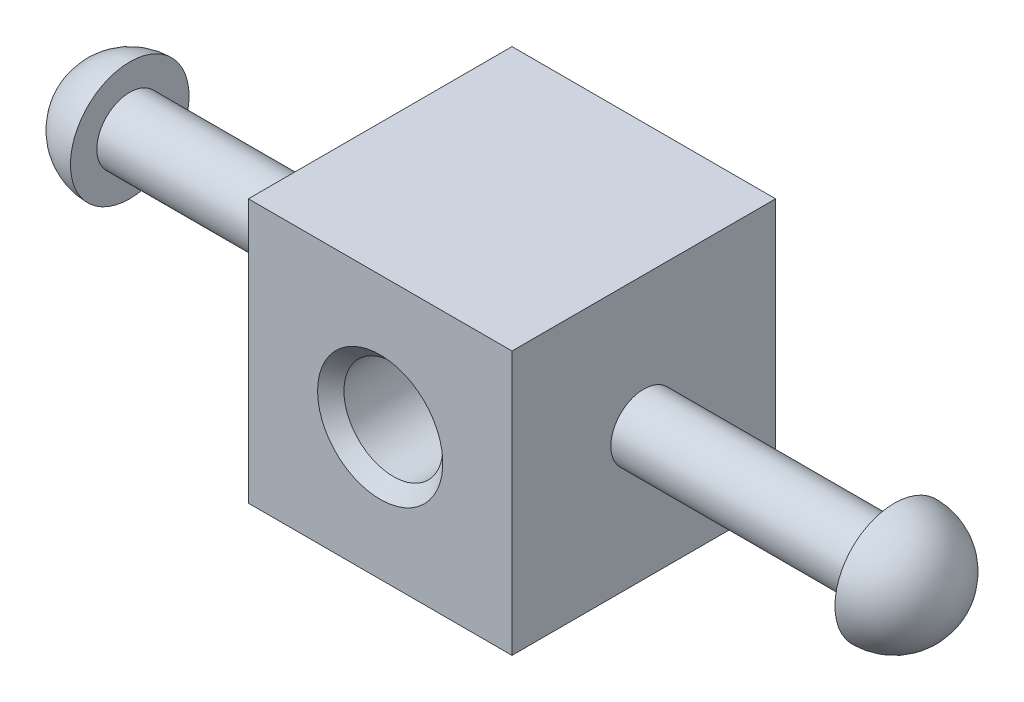
ISO-10303-21;
HEADER;
FILE_DESCRIPTION(('STEP AP214'),'2;1');
FILE_NAME('part.step','',(''),(''),'','','');
FILE_SCHEMA(('AUTOMOTIVE_DESIGN { 1 0 10303 214 1 1 1 1 }'));
ENDSEC;
DATA;
#1=APPLICATION_CONTEXT('core data for automotive mechanical design processes');
#2=APPLICATION_PROTOCOL_DEFINITION('international standard','automotive_design',2000,#1);
#3=PRODUCT_CONTEXT('',#1,'mechanical');
#4=PRODUCT('Part','Part','',(#3));
#5=PRODUCT_RELATED_PRODUCT_CATEGORY('part','',(#4));
#6=PRODUCT_DEFINITION_FORMATION('','',#4);
#7=PRODUCT_DEFINITION_CONTEXT('part definition',#1,'design');
#8=PRODUCT_DEFINITION('design','',#6,#7);
#9=PRODUCT_DEFINITION_SHAPE('','',#8);
#10=(LENGTH_UNIT() NAMED_UNIT(*) SI_UNIT(.MILLI.,.METRE.));
#11=(NAMED_UNIT(*) PLANE_ANGLE_UNIT() SI_UNIT($,.RADIAN.));
#12=(NAMED_UNIT(*) SI_UNIT($,.STERADIAN.) SOLID_ANGLE_UNIT());
#13=UNCERTAINTY_MEASURE_WITH_UNIT(LENGTH_MEASURE(1.E-05),#10,'distance_accuracy_value','');
#14=(GEOMETRIC_REPRESENTATION_CONTEXT(3) GLOBAL_UNCERTAINTY_ASSIGNED_CONTEXT((#13)) GLOBAL_UNIT_ASSIGNED_CONTEXT((#10,
#11,#12)) REPRESENTATION_CONTEXT('',''));
#15=CARTESIAN_POINT('',(0.,0.,0.));
#16=DIRECTION('',(0.,0.,1.));
#17=DIRECTION('',(1.,0.,0.));
#18=AXIS2_PLACEMENT_3D('',#15,#16,#17);
#19=CARTESIAN_POINT('',(0.,0.,0.));
#20=DIRECTION('',(-1.,0.,0.));
#21=DIRECTION('',(0.,-1.,0.));
#22=AXIS2_PLACEMENT_3D('',#19,#20,#21);
#23=CYLINDRICAL_SURFACE('',#22,3.175);
#24=CARTESIAN_POINT('',(79.375,0.,0.));
#25=DIRECTION('',(-1.,0.,0.));
#26=DIRECTION('',(0.,-1.,0.));
#27=AXIS2_PLACEMENT_3D('',#24,#25,#26);
#28=CIRCLE('',#27,3.175);
#29=CARTESIAN_POINT('',(79.375,-3.17499999999999,0.));
#30=VERTEX_POINT('',#29);
#31=EDGE_CURVE('E141',#30,#30,#28,.T.);
#32=ORIENTED_EDGE('',*,*,#31,.T.);
#33=EDGE_LOOP('',(#32));
#34=FACE_BOUND('',#33,.T.);
#35=CARTESIAN_POINT('',(55.245,0.,0.));
#36=DIRECTION('',(-1.,0.,0.));
#37=DIRECTION('',(0.,0.,1.));
#38=AXIS2_PLACEMENT_3D('',#35,#36,#37);
#39=CIRCLE('',#38,3.175);
#40=CARTESIAN_POINT('',(55.245,0.,3.175));
#41=VERTEX_POINT('',#40);
#42=EDGE_CURVE('E157',#41,#41,#39,.T.);
#43=ORIENTED_EDGE('',*,*,#42,.F.);
#44=EDGE_LOOP('',(#43));
#45=FACE_BOUND('',#44,.T.);
#46=ADVANCED_FACE('F47',(#34,#45),#23,.T.);
#47=CARTESIAN_POINT('',(79.375,5.71500000000001,0.));
#48=DIRECTION('',(1.,0.,0.));
#49=DIRECTION('',(0.,1.,0.));
#50=AXIS2_PLACEMENT_3D('',#47,#48,#49);
#51=PLANE('',#50);
#52=ORIENTED_EDGE('',*,*,#31,.F.);
#53=EDGE_LOOP('',(#52));
#54=FACE_BOUND('',#53,.T.);
#55=CARTESIAN_POINT('',(79.375,0.,0.));
#56=DIRECTION('',(-1.,0.,0.));
#57=DIRECTION('',(0.,-1.,0.));
#58=AXIS2_PLACEMENT_3D('',#55,#56,#57);
#59=CIRCLE('',#58,5.715);
#60=CARTESIAN_POINT('',(79.375,-5.71499999999999,0.));
#61=VERTEX_POINT('',#60);
#62=EDGE_CURVE('E137',#61,#61,#59,.T.);
#63=ORIENTED_EDGE('',*,*,#62,.T.);
#64=EDGE_LOOP('',(#63));
#65=FACE_BOUND('',#64,.T.);
#66=ADVANCED_FACE('F201',(#54,#65),#51,.F.);
#67=CARTESIAN_POINT('',(79.375,0.,0.));
#68=DIRECTION('',(-1.,0.,0.));
#69=DIRECTION('',(0.,1.,0.));
#70=AXIS2_PLACEMENT_3D('',#67,#68,#69);
#71=SPHERICAL_SURFACE('',#70,5.715);
#72=ORIENTED_EDGE('',*,*,#62,.F.);
#73=EDGE_LOOP('',(#72));
#74=FACE_BOUND('',#73,.T.);
#75=ADVANCED_FACE('F210',(#74),#71,.T.);
#76=CARTESIAN_POINT('',(55.245,-12.7,12.7));
#77=DIRECTION('',(-1.,0.,0.));
#78=DIRECTION('',(0.,0.,1.));
#79=AXIS2_PLACEMENT_3D('',#76,#77,#78);
#80=PLANE('',#79);
#81=ORIENTED_EDGE('',*,*,#42,.T.);
#82=EDGE_LOOP('',(#81));
#83=FACE_BOUND('',#82,.T.);
#84=DIRECTION('',(0.,1.,0.));
#85=VECTOR('',#84,1.);
#86=CARTESIAN_POINT('',(55.245,-12.7,-12.7));
#87=LINE('',#86,#85);
#88=CARTESIAN_POINT('',(55.245,-12.7,-12.7));
#89=VERTEX_POINT('',#88);
#90=CARTESIAN_POINT('',(55.245,12.7,-12.7));
#91=VERTEX_POINT('',#90);
#92=EDGE_CURVE('E121',#89,#91,#87,.T.);
#93=ORIENTED_EDGE('',*,*,#92,.T.);
#94=DIRECTION('',(0.,0.,-1.));
#95=VECTOR('',#94,1.);
#96=CARTESIAN_POINT('',(55.245,12.7,12.7));
#97=LINE('',#96,#95);
#98=CARTESIAN_POINT('',(55.245,12.7,12.7));
#99=VERTEX_POINT('',#98);
#100=EDGE_CURVE('E110',#99,#91,#97,.T.);
#101=ORIENTED_EDGE('',*,*,#100,.F.);
#102=DIRECTION('',(0.,1.,0.));
#103=VECTOR('',#102,1.);
#104=CARTESIAN_POINT('',(55.245,-12.7,12.7));
#105=LINE('',#104,#103);
#106=CARTESIAN_POINT('',(55.245,-12.7,12.7));
#107=VERTEX_POINT('',#106);
#108=EDGE_CURVE('E102',#107,#99,#105,.T.);
#109=ORIENTED_EDGE('',*,*,#108,.F.);
#110=DIRECTION('',(0.,0.,-1.));
#111=VECTOR('',#110,1.);
#112=CARTESIAN_POINT('',(55.245,-12.7,12.7));
#113=LINE('',#112,#111);
#114=EDGE_CURVE('E117',#107,#89,#113,.T.);
#115=ORIENTED_EDGE('',*,*,#114,.T.);
#116=EDGE_LOOP('',(#93,#101,#109,#115));
#117=FACE_BOUND('',#116,.T.);
#118=ADVANCED_FACE('F187',(#83,#117),#80,.F.);
#119=CARTESIAN_POINT('',(29.845,12.7,12.7));
#120=DIRECTION('',(0.,-1.,0.));
#121=DIRECTION('',(0.,0.,-1.));
#122=AXIS2_PLACEMENT_3D('',#119,#120,#121);
#123=PLANE('',#122);
#124=DIRECTION('',(-1.,0.,0.));
#125=VECTOR('',#124,1.);
#126=CARTESIAN_POINT('',(29.845,12.7,-12.7));
#127=LINE('',#126,#125);
#128=CARTESIAN_POINT('',(29.845,12.7,-12.7));
#129=VERTEX_POINT('',#128);
#130=EDGE_CURVE('E108',#91,#129,#127,.T.);
#131=ORIENTED_EDGE('',*,*,#130,.T.);
#132=DIRECTION('',(0.,0.,-1.));
#133=VECTOR('',#132,1.);
#134=CARTESIAN_POINT('',(29.845,12.7,12.7));
#135=LINE('',#134,#133);
#136=CARTESIAN_POINT('',(29.845,12.7,12.7));
#137=VERTEX_POINT('',#136);
#138=EDGE_CURVE('E106',#137,#129,#135,.T.);
#139=ORIENTED_EDGE('',*,*,#138,.F.);
#140=DIRECTION('',(-1.,0.,0.));
#141=VECTOR('',#140,1.);
#142=CARTESIAN_POINT('',(29.845,12.7,12.7));
#143=LINE('',#142,#141);
#144=EDGE_CURVE('E97',#99,#137,#143,.T.);
#145=ORIENTED_EDGE('',*,*,#144,.F.);
#146=ORIENTED_EDGE('',*,*,#100,.T.);
#147=EDGE_LOOP('',(#131,#139,#145,#146));
#148=FACE_BOUND('',#147,.T.);
#149=ADVANCED_FACE('F107',(#148),#123,.F.);
#150=CARTESIAN_POINT('',(29.845,-12.7,12.7));
#151=DIRECTION('',(1.,0.,0.));
#152=DIRECTION('',(0.,0.,-1.));
#153=AXIS2_PLACEMENT_3D('',#150,#151,#152);
#154=PLANE('',#153);
#155=CARTESIAN_POINT('',(29.845,0.,0.));
#156=DIRECTION('',(1.,0.,0.));
#157=DIRECTION('',(0.,0.,-1.));
#158=AXIS2_PLACEMENT_3D('',#155,#156,#157);
#159=CIRCLE('',#158,3.175);
#160=CARTESIAN_POINT('',(29.845,0.,-3.175));
#161=VERTEX_POINT('',#160);
#162=EDGE_CURVE('E153',#161,#161,#159,.T.);
#163=ORIENTED_EDGE('',*,*,#162,.T.);
#164=EDGE_LOOP('',(#163));
#165=FACE_BOUND('',#164,.T.);
#166=DIRECTION('',(0.,-1.,0.));
#167=VECTOR('',#166,1.);
#168=CARTESIAN_POINT('',(29.845,-12.7,-12.7));
#169=LINE('',#168,#167);
#170=CARTESIAN_POINT('',(29.845,-12.7,-12.7));
#171=VERTEX_POINT('',#170);
#172=EDGE_CURVE('E83',#129,#171,#169,.T.);
#173=ORIENTED_EDGE('',*,*,#172,.T.);
#174=DIRECTION('',(0.,0.,-1.));
#175=VECTOR('',#174,1.);
#176=CARTESIAN_POINT('',(29.845,-12.7,12.7));
#177=LINE('',#176,#175);
#178=CARTESIAN_POINT('',(29.845,-12.7,12.7));
#179=VERTEX_POINT('',#178);
#180=EDGE_CURVE('E111',#179,#171,#177,.T.);
#181=ORIENTED_EDGE('',*,*,#180,.F.);
#182=DIRECTION('',(0.,-1.,0.));
#183=VECTOR('',#182,1.);
#184=CARTESIAN_POINT('',(29.845,-12.7,12.7));
#185=LINE('',#184,#183);
#186=EDGE_CURVE('E100',#137,#179,#185,.T.);
#187=ORIENTED_EDGE('',*,*,#186,.F.);
#188=ORIENTED_EDGE('',*,*,#138,.T.);
#189=EDGE_LOOP('',(#173,#181,#187,#188));
#190=FACE_BOUND('',#189,.T.);
#191=ADVANCED_FACE('F113',(#165,#190),#154,.F.);
#192=CARTESIAN_POINT('',(29.845,-12.7,12.7));
#193=DIRECTION('',(0.,1.,0.));
#194=DIRECTION('',(0.,0.,1.));
#195=AXIS2_PLACEMENT_3D('',#192,#193,#194);
#196=PLANE('',#195);
#197=DIRECTION('',(1.,0.,0.));
#198=VECTOR('',#197,1.);
#199=CARTESIAN_POINT('',(29.845,-12.7,-12.7));
#200=LINE('',#199,#198);
#201=EDGE_CURVE('E89',#171,#89,#200,.T.);
#202=ORIENTED_EDGE('',*,*,#201,.T.);
#203=ORIENTED_EDGE('',*,*,#114,.F.);
#204=DIRECTION('',(1.,0.,0.));
#205=VECTOR('',#204,1.);
#206=CARTESIAN_POINT('',(29.845,-12.7,12.7));
#207=LINE('',#206,#205);
#208=EDGE_CURVE('E66',#179,#107,#207,.T.);
#209=ORIENTED_EDGE('',*,*,#208,.F.);
#210=ORIENTED_EDGE('',*,*,#180,.T.);
#211=EDGE_LOOP('',(#202,#203,#209,#210));
#212=FACE_BOUND('',#211,.T.);
#213=ADVANCED_FACE('F188',(#212),#196,.F.);
#214=CARTESIAN_POINT('',(0.,0.,12.7));
#215=DIRECTION('',(0.,0.,-1.));
#216=DIRECTION('',(-1.,0.,0.));
#217=AXIS2_PLACEMENT_3D('',#214,#215,#216);
#218=PLANE('',#217);
#219=CARTESIAN_POINT('',(42.545,0.,12.7));
#220=DIRECTION('',(0.,0.,-1.));
#221=DIRECTION('',(-1.,0.,0.));
#222=AXIS2_PLACEMENT_3D('',#219,#220,#221);
#223=CIRCLE('',#222,6.03250000000001);
#224=CARTESIAN_POINT('',(36.5125,0.,12.7));
#225=VERTEX_POINT('',#224);
#226=EDGE_CURVE('E11',#225,#225,#223,.T.);
#227=ORIENTED_EDGE('',*,*,#226,.T.);
#228=EDGE_LOOP('',(#227));
#229=FACE_BOUND('',#228,.T.);
#230=ORIENTED_EDGE('',*,*,#108,.T.);
#231=ORIENTED_EDGE('',*,*,#144,.T.);
#232=ORIENTED_EDGE('',*,*,#186,.T.);
#233=ORIENTED_EDGE('',*,*,#208,.T.);
#234=EDGE_LOOP('',(#230,#231,#232,#233));
#235=FACE_BOUND('',#234,.T.);
#236=ADVANCED_FACE('F98',(#229,#235),#218,.F.);
#237=CARTESIAN_POINT('',(0.,0.,-12.7));
#238=DIRECTION('',(0.,0.,-1.));
#239=DIRECTION('',(-1.,0.,0.));
#240=AXIS2_PLACEMENT_3D('',#237,#238,#239);
#241=PLANE('',#240);
#242=CARTESIAN_POINT('',(42.545,0.,-12.7));
#243=DIRECTION('',(0.,0.,-1.));
#244=DIRECTION('',(-1.,0.,0.));
#245=AXIS2_PLACEMENT_3D('',#242,#243,#244);
#246=CIRCLE('',#245,6.03250000000002);
#247=CARTESIAN_POINT('',(36.5125,0.,-12.7));
#248=VERTEX_POINT('',#247);
#249=EDGE_CURVE('E161',#248,#248,#246,.F.);
#250=ORIENTED_EDGE('',*,*,#249,.T.);
#251=EDGE_LOOP('',(#250));
#252=FACE_BOUND('',#251,.T.);
#253=ORIENTED_EDGE('',*,*,#92,.F.);
#254=ORIENTED_EDGE('',*,*,#201,.F.);
#255=ORIENTED_EDGE('',*,*,#172,.F.);
#256=ORIENTED_EDGE('',*,*,#130,.F.);
#257=EDGE_LOOP('',(#253,#254,#255,#256));
#258=FACE_BOUND('',#257,.T.);
#259=ADVANCED_FACE('F180',(#252,#258),#241,.T.);
#260=CARTESIAN_POINT('',(5.715,0.,0.));
#261=DIRECTION('',(-1.,0.,0.));
#262=DIRECTION('',(0.,1.,0.));
#263=AXIS2_PLACEMENT_3D('',#260,#261,#262);
#264=SPHERICAL_SURFACE('',#263,5.715);
#265=CARTESIAN_POINT('',(5.715,0.,0.));
#266=DIRECTION('',(-1.,0.,0.));
#267=DIRECTION('',(0.,-1.,0.));
#268=AXIS2_PLACEMENT_3D('',#265,#266,#267);
#269=CIRCLE('',#268,5.715);
#270=CARTESIAN_POINT('',(5.715,-5.715,0.));
#271=VERTEX_POINT('',#270);
#272=EDGE_CURVE('E149',#271,#271,#269,.T.);
#273=ORIENTED_EDGE('',*,*,#272,.T.);
#274=EDGE_LOOP('',(#273));
#275=FACE_BOUND('',#274,.T.);
#276=ADVANCED_FACE('F183',(#275),#264,.T.);
#277=CARTESIAN_POINT('',(5.715,5.715,0.));
#278=DIRECTION('',(-1.,0.,0.));
#279=DIRECTION('',(0.,-1.,0.));
#280=AXIS2_PLACEMENT_3D('',#277,#278,#279);
#281=PLANE('',#280);
#282=ORIENTED_EDGE('',*,*,#272,.F.);
#283=EDGE_LOOP('',(#282));
#284=FACE_BOUND('',#283,.T.);
#285=CARTESIAN_POINT('',(5.715,0.,0.));
#286=DIRECTION('',(-1.,0.,0.));
#287=DIRECTION('',(0.,-1.,0.));
#288=AXIS2_PLACEMENT_3D('',#285,#286,#287);
#289=CIRCLE('',#288,3.175);
#290=CARTESIAN_POINT('',(5.715,-3.175,0.));
#291=VERTEX_POINT('',#290);
#292=EDGE_CURVE('E145',#291,#291,#289,.T.);
#293=ORIENTED_EDGE('',*,*,#292,.T.);
#294=EDGE_LOOP('',(#293));
#295=FACE_BOUND('',#294,.T.);
#296=ADVANCED_FACE('F215',(#284,#295),#281,.F.);
#297=ORIENTED_EDGE('',*,*,#292,.F.);
#298=EDGE_LOOP('',(#297));
#299=FACE_BOUND('',#298,.T.);
#300=ORIENTED_EDGE('',*,*,#162,.F.);
#301=EDGE_LOOP('',(#300));
#302=FACE_BOUND('',#301,.T.);
#303=ADVANCED_FACE('F204',(#299,#302),#23,.T.);
#304=CARTESIAN_POINT('',(42.545,0.,-12.7));
#305=DIRECTION('',(0.,0.,1.));
#306=DIRECTION('',(1.,0.,0.));
#307=AXIS2_PLACEMENT_3D('',#304,#305,#306);
#308=CYLINDRICAL_SURFACE('',#307,4.7625);
#309=CARTESIAN_POINT('',(42.545,0.,-11.43));
#310=DIRECTION('',(0.,0.,-1.));
#311=DIRECTION('',(-1.,0.,0.));
#312=AXIS2_PLACEMENT_3D('',#309,#310,#311);
#313=CIRCLE('',#312,4.7625);
#314=CARTESIAN_POINT('',(37.7825,0.,-11.43));
#315=VERTEX_POINT('',#314);
#316=EDGE_CURVE('E58',#315,#315,#313,.T.);
#317=ORIENTED_EDGE('',*,*,#316,.T.);
#318=EDGE_LOOP('',(#317));
#319=FACE_BOUND('',#318,.T.);
#320=CARTESIAN_POINT('',(42.545,0.,11.43));
#321=DIRECTION('',(0.,0.,-1.));
#322=DIRECTION('',(-1.,0.,0.));
#323=AXIS2_PLACEMENT_3D('',#320,#321,#322);
#324=CIRCLE('',#323,4.7625);
#325=CARTESIAN_POINT('',(37.7825,0.,11.43));
#326=VERTEX_POINT('',#325);
#327=EDGE_CURVE('E165',#326,#326,#324,.F.);
#328=ORIENTED_EDGE('',*,*,#327,.T.);
#329=EDGE_LOOP('',(#328));
#330=FACE_BOUND('',#329,.T.);
#331=ADVANCED_FACE('F172',(#319,#330),#308,.F.);
#332=CARTESIAN_POINT('',(42.545,0.,-12.7));
#333=DIRECTION('',(0.,0.,-1.));
#334=DIRECTION('',(-1.,0.,0.));
#335=AXIS2_PLACEMENT_3D('',#332,#333,#334);
#336=CONICAL_SURFACE('',#335,6.03250000000002,0.785398163397447);
#337=ORIENTED_EDGE('',*,*,#316,.F.);
#338=EDGE_LOOP('',(#337));
#339=FACE_BOUND('',#338,.T.);
#340=ORIENTED_EDGE('',*,*,#249,.F.);
#341=EDGE_LOOP('',(#340));
#342=FACE_BOUND('',#341,.T.);
#343=ADVANCED_FACE('F175',(#339,#342),#336,.F.);
#344=CARTESIAN_POINT('',(42.545,0.,11.43));
#345=DIRECTION('',(0.,0.,1.));
#346=DIRECTION('',(1.,0.,0.));
#347=AXIS2_PLACEMENT_3D('',#344,#345,#346);
#348=CONICAL_SURFACE('',#347,4.7625,0.785398163397451);
#349=ORIENTED_EDGE('',*,*,#226,.F.);
#350=EDGE_LOOP('',(#349));
#351=FACE_BOUND('',#350,.T.);
#352=ORIENTED_EDGE('',*,*,#327,.F.);
#353=EDGE_LOOP('',(#352));
#354=FACE_BOUND('',#353,.T.);
#355=ADVANCED_FACE('F50',(#351,#354),#348,.F.);
#356=CLOSED_SHELL('',(#46,#66,#75,#118,#149,#191,#213,#236,#259,#276,#296,#303,#331,#343,#355));
#357=MANIFOLD_SOLID_BREP('B2',#356);
#358=ADVANCED_BREP_SHAPE_REPRESENTATION('',(#18,#357),#14);
#359=SHAPE_DEFINITION_REPRESENTATION(#9,#358);
ENDSEC;
END-ISO-10303-21;
